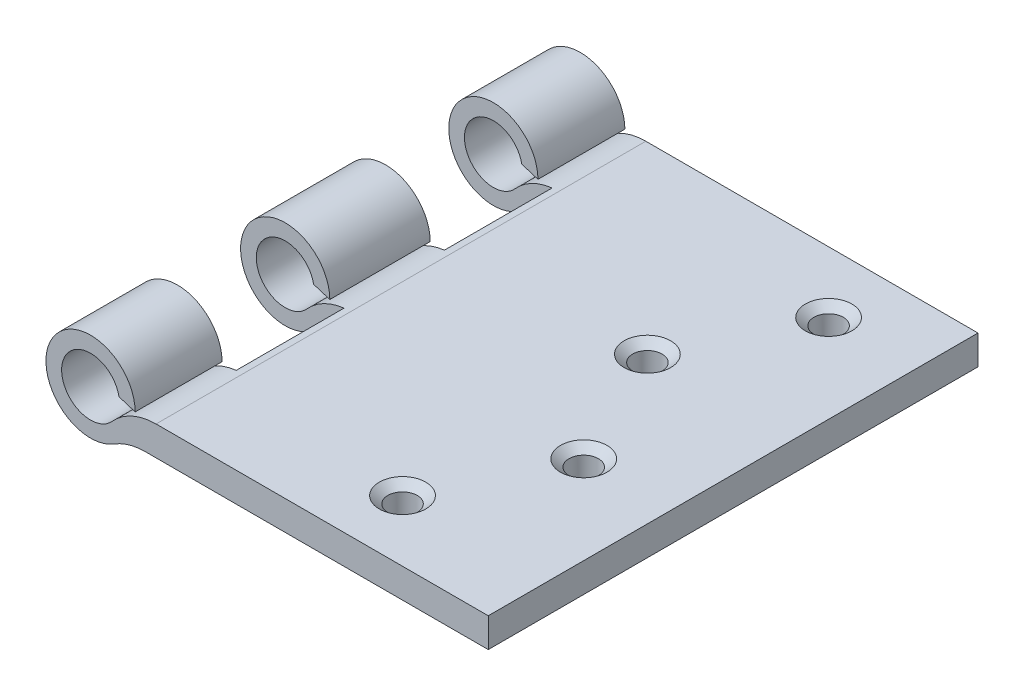
ISO-10303-21;
HEADER;
FILE_DESCRIPTION(('STEP AP214'),'2;1');
FILE_NAME('part.step','',(''),(''),'','','');
FILE_SCHEMA(('AUTOMOTIVE_DESIGN { 1 0 10303 214 1 1 1 1 }'));
ENDSEC;
DATA;
#1=APPLICATION_CONTEXT('core data for automotive mechanical design processes');
#2=APPLICATION_PROTOCOL_DEFINITION('international standard','automotive_design',2000,#1);
#3=PRODUCT_CONTEXT('',#1,'mechanical');
#4=PRODUCT('Part','Part','',(#3));
#5=PRODUCT_RELATED_PRODUCT_CATEGORY('part','',(#4));
#6=PRODUCT_DEFINITION_FORMATION('','',#4);
#7=PRODUCT_DEFINITION_CONTEXT('part definition',#1,'design');
#8=PRODUCT_DEFINITION('design','',#6,#7);
#9=PRODUCT_DEFINITION_SHAPE('','',#8);
#10=(LENGTH_UNIT() NAMED_UNIT(*) SI_UNIT(.MILLI.,.METRE.));
#11=(NAMED_UNIT(*) PLANE_ANGLE_UNIT() SI_UNIT($,.RADIAN.));
#12=(NAMED_UNIT(*) SI_UNIT($,.STERADIAN.) SOLID_ANGLE_UNIT());
#13=UNCERTAINTY_MEASURE_WITH_UNIT(LENGTH_MEASURE(1.E-05),#10,'distance_accuracy_value','');
#14=(GEOMETRIC_REPRESENTATION_CONTEXT(3) GLOBAL_UNCERTAINTY_ASSIGNED_CONTEXT((#13)) GLOBAL_UNIT_ASSIGNED_CONTEXT((#10,
#11,#12)) REPRESENTATION_CONTEXT('',''));
#15=CARTESIAN_POINT('',(0.,0.,0.));
#16=DIRECTION('',(0.,0.,1.));
#17=DIRECTION('',(1.,0.,0.));
#18=AXIS2_PLACEMENT_3D('',#15,#16,#17);
#19=CARTESIAN_POINT('',(6.68804904288239,-5.955,25.));
#20=DIRECTION('',(0.,0.,-1.));
#21=DIRECTION('',(-1.,0.,0.));
#22=AXIS2_PLACEMENT_3D('',#19,#20,#21);
#23=CYLINDRICAL_SURFACE('',#22,6.);
#24=CARTESIAN_POINT('',(6.68804904288239,-5.955,-16.125));
#25=DIRECTION('',(0.,0.,1.));
#26=DIRECTION('',(1.,0.,0.));
#27=AXIS2_PLACEMENT_3D('',#24,#25,#26);
#28=CIRCLE('',#27,6.);
#29=CARTESIAN_POINT('',(6.,0.00541848485394788,-16.125));
#30=VERTEX_POINT('',#29);
#31=CARTESIAN_POINT('',(2.20694415652903,-1.96505025125628,-16.125));
#32=VERTEX_POINT('',#31);
#33=EDGE_CURVE('E300',#30,#32,#28,.T.);
#34=ORIENTED_EDGE('',*,*,#33,.F.);
#35=DIRECTION('',(0.,0.,-1.));
#36=VECTOR('',#35,1.);
#37=CARTESIAN_POINT('',(6.00000000000002,0.00541848485394961,25.));
#38=LINE('',#37,#36);
#39=CARTESIAN_POINT('',(6.,0.00541848485394788,-5.125));
#40=VERTEX_POINT('',#39);
#41=EDGE_CURVE('E302',#40,#30,#38,.T.);
#42=ORIENTED_EDGE('',*,*,#41,.F.);
#43=CARTESIAN_POINT('',(6.68804904288239,-5.955,-5.125));
#44=DIRECTION('',(0.,0.,-1.));
#45=DIRECTION('',(-1.,0.,0.));
#46=AXIS2_PLACEMENT_3D('',#43,#44,#45);
#47=CIRCLE('',#46,6.);
#48=CARTESIAN_POINT('',(2.20694415652903,-1.96505025125628,-5.125));
#49=VERTEX_POINT('',#48);
#50=EDGE_CURVE('E290',#49,#40,#47,.T.);
#51=ORIENTED_EDGE('',*,*,#50,.F.);
#52=DIRECTION('',(0.,0.,-1.));
#53=VECTOR('',#52,1.);
#54=CARTESIAN_POINT('',(2.20694415652903,-1.96505025125628,25.));
#55=LINE('',#54,#53);
#56=CARTESIAN_POINT('',(2.20694415652903,-1.96505025125628,5.125));
#57=VERTEX_POINT('',#56);
#58=EDGE_CURVE('E358',#57,#49,#55,.T.);
#59=ORIENTED_EDGE('',*,*,#58,.F.);
#60=CARTESIAN_POINT('',(6.68804904288239,-5.955,5.125));
#61=DIRECTION('',(0.,0.,1.));
#62=DIRECTION('',(1.,0.,0.));
#63=AXIS2_PLACEMENT_3D('',#60,#61,#62);
#64=CIRCLE('',#63,6.);
#65=CARTESIAN_POINT('',(6.,0.00541848485394788,5.125));
#66=VERTEX_POINT('',#65);
#67=EDGE_CURVE('E278',#66,#57,#64,.T.);
#68=ORIENTED_EDGE('',*,*,#67,.F.);
#69=DIRECTION('',(0.,0.,-1.));
#70=VECTOR('',#69,1.);
#71=CARTESIAN_POINT('',(6.00000000000001,0.00541848485394875,25.));
#72=LINE('',#71,#70);
#73=CARTESIAN_POINT('',(6.00000000000001,0.00541848485394875,16.125));
#74=VERTEX_POINT('',#73);
#75=EDGE_CURVE('E280',#74,#66,#72,.T.);
#76=ORIENTED_EDGE('',*,*,#75,.F.);
#77=CARTESIAN_POINT('',(6.68804904288239,-5.955,16.125));
#78=DIRECTION('',(0.,0.,-1.));
#79=DIRECTION('',(-1.,0.,0.));
#80=AXIS2_PLACEMENT_3D('',#77,#78,#79);
#81=CIRCLE('',#80,6.);
#82=CARTESIAN_POINT('',(2.20694415652903,-1.96505025125628,16.125));
#83=VERTEX_POINT('',#82);
#84=EDGE_CURVE('E268',#83,#74,#81,.T.);
#85=ORIENTED_EDGE('',*,*,#84,.F.);
#86=CARTESIAN_POINT('',(2.20694415652903,-1.96505025125628,25.));
#87=VERTEX_POINT('',#86);
#88=EDGE_CURVE('E354',#87,#83,#55,.T.);
#89=ORIENTED_EDGE('',*,*,#88,.F.);
#90=CARTESIAN_POINT('',(6.68804904288239,-5.955,25.));
#91=DIRECTION('',(0.,0.,1.));
#92=DIRECTION('',(1.,0.,0.));
#93=AXIS2_PLACEMENT_3D('',#90,#91,#92);
#94=CIRCLE('',#93,6.);
#95=CARTESIAN_POINT('',(6.68804904288239,0.0449999999999999,25.));
#96=VERTEX_POINT('',#95);
#97=EDGE_CURVE('E305',#96,#87,#94,.T.);
#98=ORIENTED_EDGE('',*,*,#97,.F.);
#99=DIRECTION('',(0.,0.,-1.));
#100=VECTOR('',#99,1.);
#101=CARTESIAN_POINT('',(6.68804904288239,0.0449999999999999,25.));
#102=LINE('',#101,#100);
#103=CARTESIAN_POINT('',(6.68804904288239,0.0449999999999999,-25.));
#104=VERTEX_POINT('',#103);
#105=EDGE_CURVE('E216',#96,#104,#102,.T.);
#106=ORIENTED_EDGE('',*,*,#105,.T.);
#107=CARTESIAN_POINT('',(6.68804904288239,-5.955,-25.));
#108=DIRECTION('',(0.,0.,1.));
#109=DIRECTION('',(1.,0.,0.));
#110=AXIS2_PLACEMENT_3D('',#107,#108,#109);
#111=CIRCLE('',#110,6.);
#112=CARTESIAN_POINT('',(2.20694415652903,-1.96505025125628,-25.));
#113=VERTEX_POINT('',#112);
#114=EDGE_CURVE('E304',#104,#113,#111,.T.);
#115=ORIENTED_EDGE('',*,*,#114,.T.);
#116=EDGE_CURVE('E352',#32,#113,#55,.T.);
#117=ORIENTED_EDGE('',*,*,#116,.F.);
#118=EDGE_LOOP('',(#34,#42,#51,#59,#68,#76,#85,#89,#98,#106,#115,#117));
#119=FACE_BOUND('',#118,.T.);
#120=ADVANCED_FACE('F36',(#119),#23,.T.);
#121=CARTESIAN_POINT('',(0.,0.,25.));
#122=DIRECTION('',(0.,0.,-1.));
#123=DIRECTION('',(-1.,0.,0.));
#124=AXIS2_PLACEMENT_3D('',#121,#122,#123);
#125=CYLINDRICAL_SURFACE('',#124,2.955);
#126=CARTESIAN_POINT('',(0.,0.,-16.125));
#127=DIRECTION('',(0.,0.,1.));
#128=DIRECTION('',(1.,0.,0.));
#129=AXIS2_PLACEMENT_3D('',#126,#127,#128);
#130=CIRCLE('',#129,2.955);
#131=CARTESIAN_POINT('',(2.90142257836706,0.560153569784056,-16.125));
#132=VERTEX_POINT('',#131);
#133=EDGE_CURVE('E298',#32,#132,#130,.F.);
#134=ORIENTED_EDGE('',*,*,#133,.F.);
#135=ORIENTED_EDGE('',*,*,#116,.T.);
#136=CARTESIAN_POINT('',(0.,0.,-25.));
#137=DIRECTION('',(0.,0.,-1.));
#138=DIRECTION('',(1.,0.,0.));
#139=AXIS2_PLACEMENT_3D('',#136,#137,#138);
#140=CIRCLE('',#139,2.955);
#141=CARTESIAN_POINT('',(2.90142257836706,0.560153569784056,-25.));
#142=VERTEX_POINT('',#141);
#143=EDGE_CURVE('E321',#113,#142,#140,.T.);
#144=ORIENTED_EDGE('',*,*,#143,.T.);
#145=DIRECTION('',(0.,0.,-1.));
#146=VECTOR('',#145,1.);
#147=CARTESIAN_POINT('',(2.90142257836706,0.560153569784056,25.));
#148=LINE('',#147,#146);
#149=EDGE_CURVE('E347',#132,#142,#148,.T.);
#150=ORIENTED_EDGE('',*,*,#149,.F.);
#151=EDGE_LOOP('',(#134,#135,#144,#150));
#152=FACE_BOUND('',#151,.T.);
#153=ADVANCED_FACE('F426',(#152),#125,.F.);
#154=CARTESIAN_POINT('',(0.,0.,-5.125));
#155=DIRECTION('',(0.,0.,-1.));
#156=DIRECTION('',(-1.,0.,0.));
#157=AXIS2_PLACEMENT_3D('',#154,#155,#156);
#158=CIRCLE('',#157,2.955);
#159=CARTESIAN_POINT('',(2.90142257836706,0.560153569784056,-5.125));
#160=VERTEX_POINT('',#159);
#161=EDGE_CURVE('E288',#160,#49,#158,.F.);
#162=ORIENTED_EDGE('',*,*,#161,.F.);
#163=CARTESIAN_POINT('',(2.90142257836706,0.560153569784056,5.125));
#164=VERTEX_POINT('',#163);
#165=EDGE_CURVE('E353',#164,#160,#148,.T.);
#166=ORIENTED_EDGE('',*,*,#165,.F.);
#167=CARTESIAN_POINT('',(0.,0.,5.125));
#168=DIRECTION('',(0.,0.,1.));
#169=DIRECTION('',(1.,0.,0.));
#170=AXIS2_PLACEMENT_3D('',#167,#168,#169);
#171=CIRCLE('',#170,2.955);
#172=EDGE_CURVE('E276',#57,#164,#171,.F.);
#173=ORIENTED_EDGE('',*,*,#172,.F.);
#174=ORIENTED_EDGE('',*,*,#58,.T.);
#175=EDGE_LOOP('',(#162,#166,#173,#174));
#176=FACE_BOUND('',#175,.T.);
#177=ADVANCED_FACE('F429',(#176),#125,.F.);
#178=CARTESIAN_POINT('',(0.,0.,16.125));
#179=DIRECTION('',(0.,0.,-1.));
#180=DIRECTION('',(-1.,0.,0.));
#181=AXIS2_PLACEMENT_3D('',#178,#179,#180);
#182=CIRCLE('',#181,2.955);
#183=CARTESIAN_POINT('',(2.90142257836706,0.560153569784056,16.125));
#184=VERTEX_POINT('',#183);
#185=EDGE_CURVE('E266',#184,#83,#182,.F.);
#186=ORIENTED_EDGE('',*,*,#185,.F.);
#187=CARTESIAN_POINT('',(2.90142257836706,0.560153569784056,25.));
#188=VERTEX_POINT('',#187);
#189=EDGE_CURVE('E349',#188,#184,#148,.T.);
#190=ORIENTED_EDGE('',*,*,#189,.F.);
#191=CARTESIAN_POINT('',(0.,0.,25.));
#192=DIRECTION('',(0.,0.,-1.));
#193=DIRECTION('',(1.,0.,0.));
#194=AXIS2_PLACEMENT_3D('',#191,#192,#193);
#195=CIRCLE('',#194,2.955);
#196=EDGE_CURVE('E308',#87,#188,#195,.T.);
#197=ORIENTED_EDGE('',*,*,#196,.F.);
#198=ORIENTED_EDGE('',*,*,#88,.T.);
#199=EDGE_LOOP('',(#186,#190,#197,#198));
#200=FACE_BOUND('',#199,.T.);
#201=ADVANCED_FACE('F424',(#200),#125,.F.);
#202=CARTESIAN_POINT('',(4.55477771137078,0.0449999999999999,25.));
#203=DIRECTION('',(0.297475301866081,0.954729513935588,0.));
#204=DIRECTION('',(-0.954729513935588,0.297475301866081,0.));
#205=AXIS2_PLACEMENT_3D('',#202,#203,#204);
#206=PLANE('',#205);
#207=DIRECTION('',(0.954729513935588,-0.297475301866081,0.));
#208=VECTOR('',#207,1.);
#209=CARTESIAN_POINT('',(4.55477771137077,0.0450000000000033,-16.125));
#210=LINE('',#209,#208);
#211=CARTESIAN_POINT('',(4.55477771137078,0.0449999999999999,-16.125));
#212=VERTEX_POINT('',#211);
#213=EDGE_CURVE('E296',#132,#212,#210,.T.);
#214=ORIENTED_EDGE('',*,*,#213,.F.);
#215=ORIENTED_EDGE('',*,*,#149,.T.);
#216=DIRECTION('',(0.954729513935588,-0.297475301866081,0.));
#217=VECTOR('',#216,1.);
#218=CARTESIAN_POINT('',(4.55477771137078,0.0449999999999999,-25.));
#219=LINE('',#218,#217);
#220=CARTESIAN_POINT('',(4.55477771137078,0.0449999999999999,-25.));
#221=VERTEX_POINT('',#220);
#222=EDGE_CURVE('E324',#142,#221,#219,.T.);
#223=ORIENTED_EDGE('',*,*,#222,.T.);
#224=DIRECTION('',(0.,0.,-1.));
#225=VECTOR('',#224,1.);
#226=CARTESIAN_POINT('',(4.55477771137078,0.0449999999999999,25.));
#227=LINE('',#226,#225);
#228=EDGE_CURVE('E342',#212,#221,#227,.T.);
#229=ORIENTED_EDGE('',*,*,#228,.F.);
#230=EDGE_LOOP('',(#214,#215,#223,#229));
#231=FACE_BOUND('',#230,.T.);
#232=ADVANCED_FACE('F420',(#231),#206,.F.);
#233=DIRECTION('',(-0.954729513935588,0.297475301866081,0.));
#234=VECTOR('',#233,1.);
#235=CARTESIAN_POINT('',(4.55477771137078,0.0449999999999999,-5.125));
#236=LINE('',#235,#234);
#237=CARTESIAN_POINT('',(4.55477771137078,0.0449999999999999,-5.125));
#238=VERTEX_POINT('',#237);
#239=EDGE_CURVE('E286',#238,#160,#236,.T.);
#240=ORIENTED_EDGE('',*,*,#239,.F.);
#241=CARTESIAN_POINT('',(4.55477771137078,0.0449999999999999,5.125));
#242=VERTEX_POINT('',#241);
#243=EDGE_CURVE('E348',#242,#238,#227,.T.);
#244=ORIENTED_EDGE('',*,*,#243,.F.);
#245=DIRECTION('',(0.954729513935588,-0.297475301866081,0.));
#246=VECTOR('',#245,1.);
#247=CARTESIAN_POINT('',(4.55477771137077,0.0450000000000015,5.125));
#248=LINE('',#247,#246);
#249=EDGE_CURVE('E274',#164,#242,#248,.T.);
#250=ORIENTED_EDGE('',*,*,#249,.F.);
#251=ORIENTED_EDGE('',*,*,#165,.T.);
#252=EDGE_LOOP('',(#240,#244,#250,#251));
#253=FACE_BOUND('',#252,.T.);
#254=ADVANCED_FACE('F423',(#253),#206,.F.);
#255=DIRECTION('',(-0.954729513935588,0.297475301866081,0.));
#256=VECTOR('',#255,1.);
#257=CARTESIAN_POINT('',(4.55477771137078,0.0449999999999999,16.125));
#258=LINE('',#257,#256);
#259=CARTESIAN_POINT('',(4.55477771137078,0.0449999999999999,16.125));
#260=VERTEX_POINT('',#259);
#261=EDGE_CURVE('E264',#260,#184,#258,.T.);
#262=ORIENTED_EDGE('',*,*,#261,.F.);
#263=CARTESIAN_POINT('',(4.55477771137078,0.0449999999999999,25.));
#264=VERTEX_POINT('',#263);
#265=EDGE_CURVE('E344',#264,#260,#227,.T.);
#266=ORIENTED_EDGE('',*,*,#265,.F.);
#267=DIRECTION('',(0.954729513935588,-0.297475301866081,0.));
#268=VECTOR('',#267,1.);
#269=CARTESIAN_POINT('',(4.55477771137078,0.0449999999999999,25.));
#270=LINE('',#269,#268);
#271=EDGE_CURVE('E310',#188,#264,#270,.T.);
#272=ORIENTED_EDGE('',*,*,#271,.F.);
#273=ORIENTED_EDGE('',*,*,#189,.T.);
#274=EDGE_LOOP('',(#262,#266,#272,#273));
#275=FACE_BOUND('',#274,.T.);
#276=ADVANCED_FACE('F418',(#275),#206,.F.);
#277=CARTESIAN_POINT('',(0.,0.,25.));
#278=DIRECTION('',(0.,0.,-1.));
#279=DIRECTION('',(-1.,0.,0.));
#280=AXIS2_PLACEMENT_3D('',#277,#278,#279);
#281=CYLINDRICAL_SURFACE('',#280,4.555);
#282=CARTESIAN_POINT('',(0.,0.,-16.125));
#283=DIRECTION('',(0.,0.,1.));
#284=DIRECTION('',(1.,0.,0.));
#285=AXIS2_PLACEMENT_3D('',#282,#283,#284);
#286=CIRCLE('',#285,4.555);
#287=CARTESIAN_POINT('',(2.41111969020166,-3.86452155376599,-16.125));
#288=VERTEX_POINT('',#287);
#289=EDGE_CURVE('E294',#212,#288,#286,.T.);
#290=ORIENTED_EDGE('',*,*,#289,.F.);
#291=ORIENTED_EDGE('',*,*,#228,.T.);
#292=CARTESIAN_POINT('',(0.,0.,-25.));
#293=DIRECTION('',(0.,0.,1.));
#294=DIRECTION('',(1.,0.,0.));
#295=AXIS2_PLACEMENT_3D('',#292,#293,#294);
#296=CIRCLE('',#295,4.555);
#297=CARTESIAN_POINT('',(2.41111969020166,-3.86452155376599,-25.));
#298=VERTEX_POINT('',#297);
#299=EDGE_CURVE('E327',#221,#298,#296,.T.);
#300=ORIENTED_EDGE('',*,*,#299,.T.);
#301=DIRECTION('',(0.,0.,-1.));
#302=VECTOR('',#301,1.);
#303=CARTESIAN_POINT('',(2.41111969020166,-3.86452155376599,25.));
#304=LINE('',#303,#302);
#305=EDGE_CURVE('E337',#288,#298,#304,.T.);
#306=ORIENTED_EDGE('',*,*,#305,.F.);
#307=EDGE_LOOP('',(#290,#291,#300,#306));
#308=FACE_BOUND('',#307,.T.);
#309=ADVANCED_FACE('F414',(#308),#281,.T.);
#310=CARTESIAN_POINT('',(0.,0.,-5.125));
#311=DIRECTION('',(0.,0.,-1.));
#312=DIRECTION('',(-1.,0.,0.));
#313=AXIS2_PLACEMENT_3D('',#310,#311,#312);
#314=CIRCLE('',#313,4.555);
#315=CARTESIAN_POINT('',(2.41111969020166,-3.86452155376599,-5.125));
#316=VERTEX_POINT('',#315);
#317=EDGE_CURVE('E284',#316,#238,#314,.T.);
#318=ORIENTED_EDGE('',*,*,#317,.F.);
#319=CARTESIAN_POINT('',(2.41111969020166,-3.86452155376599,5.125));
#320=VERTEX_POINT('',#319);
#321=EDGE_CURVE('E343',#320,#316,#304,.T.);
#322=ORIENTED_EDGE('',*,*,#321,.F.);
#323=CARTESIAN_POINT('',(0.,0.,5.125));
#324=DIRECTION('',(0.,0.,1.));
#325=DIRECTION('',(1.,0.,0.));
#326=AXIS2_PLACEMENT_3D('',#323,#324,#325);
#327=CIRCLE('',#326,4.555);
#328=EDGE_CURVE('E272',#242,#320,#327,.T.);
#329=ORIENTED_EDGE('',*,*,#328,.F.);
#330=ORIENTED_EDGE('',*,*,#243,.T.);
#331=EDGE_LOOP('',(#318,#322,#329,#330));
#332=FACE_BOUND('',#331,.T.);
#333=ADVANCED_FACE('F417',(#332),#281,.T.);
#334=CARTESIAN_POINT('',(0.,0.,16.125));
#335=DIRECTION('',(0.,0.,-1.));
#336=DIRECTION('',(-1.,0.,0.));
#337=AXIS2_PLACEMENT_3D('',#334,#335,#336);
#338=CIRCLE('',#337,4.555);
#339=CARTESIAN_POINT('',(2.41111969020166,-3.86452155376599,16.125));
#340=VERTEX_POINT('',#339);
#341=EDGE_CURVE('E262',#340,#260,#338,.T.);
#342=ORIENTED_EDGE('',*,*,#341,.F.);
#343=CARTESIAN_POINT('',(2.41111969020166,-3.86452155376599,25.));
#344=VERTEX_POINT('',#343);
#345=EDGE_CURVE('E339',#344,#340,#304,.T.);
#346=ORIENTED_EDGE('',*,*,#345,.F.);
#347=CARTESIAN_POINT('',(0.,0.,25.));
#348=DIRECTION('',(0.,0.,1.));
#349=DIRECTION('',(1.,0.,0.));
#350=AXIS2_PLACEMENT_3D('',#347,#348,#349);
#351=CIRCLE('',#350,4.555);
#352=EDGE_CURVE('E312',#264,#344,#351,.T.);
#353=ORIENTED_EDGE('',*,*,#352,.F.);
#354=ORIENTED_EDGE('',*,*,#265,.T.);
#355=EDGE_LOOP('',(#342,#346,#353,#354));
#356=FACE_BOUND('',#355,.T.);
#357=ADVANCED_FACE('F412',(#356),#281,.T.);
#358=CARTESIAN_POINT('',(5.58712806368353,-8.955,25.));
#359=DIRECTION('',(0.,0.,-1.));
#360=DIRECTION('',(-1.,0.,0.));
#361=AXIS2_PLACEMENT_3D('',#358,#359,#360);
#362=CYLINDRICAL_SURFACE('',#361,6.);
#363=CARTESIAN_POINT('',(5.58712806368353,-8.955,-16.125));
#364=DIRECTION('',(0.,0.,1.));
#365=DIRECTION('',(1.,0.,0.));
#366=AXIS2_PLACEMENT_3D('',#363,#364,#365);
#367=CIRCLE('',#366,6.);
#368=CARTESIAN_POINT('',(5.58712806368353,-2.955,-16.125));
#369=VERTEX_POINT('',#368);
#370=EDGE_CURVE('E292',#288,#369,#367,.F.);
#371=ORIENTED_EDGE('',*,*,#370,.F.);
#372=ORIENTED_EDGE('',*,*,#305,.T.);
#373=CARTESIAN_POINT('',(5.58712806368353,-8.955,-25.));
#374=DIRECTION('',(0.,0.,-1.));
#375=DIRECTION('',(1.,0.,0.));
#376=AXIS2_PLACEMENT_3D('',#373,#374,#375);
#377=CIRCLE('',#376,6.);
#378=CARTESIAN_POINT('',(5.58712806368353,-2.955,-25.));
#379=VERTEX_POINT('',#378);
#380=EDGE_CURVE('E208',#298,#379,#377,.T.);
#381=ORIENTED_EDGE('',*,*,#380,.T.);
#382=DIRECTION('',(0.,0.,-1.));
#383=VECTOR('',#382,1.);
#384=CARTESIAN_POINT('',(5.58712806368353,-2.955,25.));
#385=LINE('',#384,#383);
#386=EDGE_CURVE('E202',#369,#379,#385,.T.);
#387=ORIENTED_EDGE('',*,*,#386,.F.);
#388=EDGE_LOOP('',(#371,#372,#381,#387));
#389=FACE_BOUND('',#388,.T.);
#390=ADVANCED_FACE('F408',(#389),#362,.F.);
#391=CARTESIAN_POINT('',(5.58712806368353,-8.955,-5.125));
#392=DIRECTION('',(0.,0.,-1.));
#393=DIRECTION('',(-1.,0.,0.));
#394=AXIS2_PLACEMENT_3D('',#391,#392,#393);
#395=CIRCLE('',#394,6.);
#396=CARTESIAN_POINT('',(5.58712806368353,-2.955,-5.125));
#397=VERTEX_POINT('',#396);
#398=EDGE_CURVE('E282',#397,#316,#395,.F.);
#399=ORIENTED_EDGE('',*,*,#398,.F.);
#400=CARTESIAN_POINT('',(5.58712806368353,-2.955,5.125));
#401=VERTEX_POINT('',#400);
#402=EDGE_CURVE('E338',#401,#397,#385,.T.);
#403=ORIENTED_EDGE('',*,*,#402,.F.);
#404=CARTESIAN_POINT('',(5.58712806368353,-8.955,5.125));
#405=DIRECTION('',(0.,0.,1.));
#406=DIRECTION('',(1.,0.,0.));
#407=AXIS2_PLACEMENT_3D('',#404,#405,#406);
#408=CIRCLE('',#407,6.);
#409=EDGE_CURVE('E270',#320,#401,#408,.F.);
#410=ORIENTED_EDGE('',*,*,#409,.F.);
#411=ORIENTED_EDGE('',*,*,#321,.T.);
#412=EDGE_LOOP('',(#399,#403,#410,#411));
#413=FACE_BOUND('',#412,.T.);
#414=ADVANCED_FACE('F411',(#413),#362,.F.);
#415=CARTESIAN_POINT('',(5.58712806368353,-8.955,16.125));
#416=DIRECTION('',(0.,0.,-1.));
#417=DIRECTION('',(-1.,0.,0.));
#418=AXIS2_PLACEMENT_3D('',#415,#416,#417);
#419=CIRCLE('',#418,6.);
#420=CARTESIAN_POINT('',(5.58712806368353,-2.955,16.125));
#421=VERTEX_POINT('',#420);
#422=EDGE_CURVE('E257',#421,#340,#419,.F.);
#423=ORIENTED_EDGE('',*,*,#422,.F.);
#424=CARTESIAN_POINT('',(5.58712806368353,-2.955,25.));
#425=VERTEX_POINT('',#424);
#426=EDGE_CURVE('E334',#425,#421,#385,.T.);
#427=ORIENTED_EDGE('',*,*,#426,.F.);
#428=CARTESIAN_POINT('',(5.58712806368353,-8.955,25.));
#429=DIRECTION('',(0.,0.,-1.));
#430=DIRECTION('',(1.,0.,0.));
#431=AXIS2_PLACEMENT_3D('',#428,#429,#430);
#432=CIRCLE('',#431,6.);
#433=EDGE_CURVE('E314',#344,#425,#432,.T.);
#434=ORIENTED_EDGE('',*,*,#433,.F.);
#435=ORIENTED_EDGE('',*,*,#345,.T.);
#436=EDGE_LOOP('',(#423,#427,#434,#435));
#437=FACE_BOUND('',#436,.T.);
#438=ADVANCED_FACE('F405',(#437),#362,.F.);
#439=CARTESIAN_POINT('',(5.58712806368353,-2.955,25.));
#440=DIRECTION('',(0.,1.,0.));
#441=DIRECTION('',(0.,0.,1.));
#442=AXIS2_PLACEMENT_3D('',#439,#440,#441);
#443=PLANE('',#442);
#444=CARTESIAN_POINT('',(31.6,-2.955,-18.75));
#445=DIRECTION('',(0.,1.,0.));
#446=DIRECTION('',(0.,0.,1.));
#447=AXIS2_PLACEMENT_3D('',#444,#445,#446);
#448=CIRCLE('',#447,1.5);
#449=CARTESIAN_POINT('',(31.6,-2.955,-17.25));
#450=VERTEX_POINT('',#449);
#451=EDGE_CURVE('E249',#450,#450,#448,.T.);
#452=ORIENTED_EDGE('',*,*,#451,.T.);
#453=EDGE_LOOP('',(#452));
#454=FACE_BOUND('',#453,.T.);
#455=CARTESIAN_POINT('',(25.6,-2.955,-6.25));
#456=DIRECTION('',(0.,1.,0.));
#457=DIRECTION('',(0.,0.,1.));
#458=AXIS2_PLACEMENT_3D('',#455,#456,#457);
#459=CIRCLE('',#458,1.5);
#460=CARTESIAN_POINT('',(25.6,-2.955,-4.75));
#461=VERTEX_POINT('',#460);
#462=EDGE_CURVE('E246',#461,#461,#459,.T.);
#463=ORIENTED_EDGE('',*,*,#462,.T.);
#464=EDGE_LOOP('',(#463));
#465=FACE_BOUND('',#464,.T.);
#466=CARTESIAN_POINT('',(31.6,-2.955,6.25));
#467=DIRECTION('',(0.,1.,0.));
#468=DIRECTION('',(0.,0.,1.));
#469=AXIS2_PLACEMENT_3D('',#466,#467,#468);
#470=CIRCLE('',#469,1.5);
#471=CARTESIAN_POINT('',(31.6,-2.955,7.75000000000001));
#472=VERTEX_POINT('',#471);
#473=EDGE_CURVE('E242',#472,#472,#470,.T.);
#474=ORIENTED_EDGE('',*,*,#473,.T.);
#475=EDGE_LOOP('',(#474));
#476=FACE_BOUND('',#475,.T.);
#477=CARTESIAN_POINT('',(25.6,-2.955,18.75));
#478=DIRECTION('',(0.,1.,0.));
#479=DIRECTION('',(0.,0.,1.));
#480=AXIS2_PLACEMENT_3D('',#477,#478,#479);
#481=CIRCLE('',#480,1.5);
#482=CARTESIAN_POINT('',(25.6,-2.955,20.25));
#483=VERTEX_POINT('',#482);
#484=EDGE_CURVE('E239',#483,#483,#481,.T.);
#485=ORIENTED_EDGE('',*,*,#484,.T.);
#486=EDGE_LOOP('',(#485));
#487=FACE_BOUND('',#486,.T.);
#488=DIRECTION('',(1.,0.,0.));
#489=VECTOR('',#488,1.);
#490=CARTESIAN_POINT('',(5.58712806368351,-2.955,-16.125));
#491=LINE('',#490,#489);
#492=CARTESIAN_POINT('',(6.,-2.955,-16.125));
#493=VERTEX_POINT('',#492);
#494=EDGE_CURVE('E368',#369,#493,#491,.T.);
#495=ORIENTED_EDGE('',*,*,#494,.F.);
#496=ORIENTED_EDGE('',*,*,#386,.T.);
#497=DIRECTION('',(1.,0.,0.));
#498=VECTOR('',#497,1.);
#499=CARTESIAN_POINT('',(5.58712806368353,-2.955,-25.));
#500=LINE('',#499,#498);
#501=CARTESIAN_POINT('',(36.,-2.95187501994081,-25.));
#502=VERTEX_POINT('',#501);
#503=EDGE_CURVE('E193',#379,#502,#500,.T.);
#504=ORIENTED_EDGE('',*,*,#503,.T.);
#505=CARTESIAN_POINT('',(36.,-2.94875003988162,25.));
#506=DIRECTION('',(0.,0.,-1.));
#507=VECTOR('',#506,1.);
#508=LINE('',#505,#507);
#509=CARTESIAN_POINT('',(36.,-2.95187501994081,25.));
#510=VERTEX_POINT('',#509);
#511=EDGE_CURVE('E198',#510,#502,#508,.T.);
#512=ORIENTED_EDGE('',*,*,#511,.F.);
#513=DIRECTION('',(1.,0.,0.));
#514=VECTOR('',#513,1.);
#515=CARTESIAN_POINT('',(5.58712806368353,-2.955,25.));
#516=LINE('',#515,#514);
#517=EDGE_CURVE('E316',#425,#510,#516,.T.);
#518=ORIENTED_EDGE('',*,*,#517,.F.);
#519=ORIENTED_EDGE('',*,*,#426,.T.);
#520=DIRECTION('',(-1.,0.,0.));
#521=VECTOR('',#520,1.);
#522=CARTESIAN_POINT('',(5.58712806368353,-2.955,16.125));
#523=LINE('',#522,#521);
#524=CARTESIAN_POINT('',(6.00000000000001,-2.955,16.125));
#525=VERTEX_POINT('',#524);
#526=EDGE_CURVE('E357',#525,#421,#523,.T.);
#527=ORIENTED_EDGE('',*,*,#526,.F.);
#528=DIRECTION('',(0.,0.,1.));
#529=VECTOR('',#528,1.);
#530=CARTESIAN_POINT('',(6.00000000000001,-2.955,25.));
#531=LINE('',#530,#529);
#532=CARTESIAN_POINT('',(6.,-2.955,5.125));
#533=VERTEX_POINT('',#532);
#534=EDGE_CURVE('E360',#533,#525,#531,.T.);
#535=ORIENTED_EDGE('',*,*,#534,.F.);
#536=DIRECTION('',(1.,0.,0.));
#537=VECTOR('',#536,1.);
#538=CARTESIAN_POINT('',(5.58712806368352,-2.955,5.125));
#539=LINE('',#538,#537);
#540=EDGE_CURVE('E362',#401,#533,#539,.T.);
#541=ORIENTED_EDGE('',*,*,#540,.F.);
#542=ORIENTED_EDGE('',*,*,#402,.T.);
#543=DIRECTION('',(-1.,0.,0.));
#544=VECTOR('',#543,1.);
#545=CARTESIAN_POINT('',(5.58712806368353,-2.955,-5.125));
#546=LINE('',#545,#544);
#547=CARTESIAN_POINT('',(6.,-2.955,-5.125));
#548=VERTEX_POINT('',#547);
#549=EDGE_CURVE('E364',#548,#397,#546,.T.);
#550=ORIENTED_EDGE('',*,*,#549,.F.);
#551=DIRECTION('',(0.,0.,1.));
#552=VECTOR('',#551,1.);
#553=CARTESIAN_POINT('',(6.00000000000002,-2.955,25.));
#554=LINE('',#553,#552);
#555=EDGE_CURVE('E366',#493,#548,#554,.T.);
#556=ORIENTED_EDGE('',*,*,#555,.F.);
#557=EDGE_LOOP('',(#495,#496,#504,#512,#518,#519,#527,#535,#541,#542,#550,#556));
#558=FACE_BOUND('',#557,.T.);
#559=ADVANCED_FACE('F196',(#454,#465,#476,#487,#558),#443,.F.);
#560=CARTESIAN_POINT('',(6.68804904288239,0.0449999999999999,25.));
#561=DIRECTION('',(0.,-1.,0.));
#562=DIRECTION('',(1.,0.,0.));
#563=AXIS2_PLACEMENT_3D('',#560,#561,#562);
#564=PLANE('',#563);
#565=CARTESIAN_POINT('',(25.6,0.0449999999999993,18.75));
#566=DIRECTION('',(0.,-1.,0.));
#567=DIRECTION('',(1.,0.,0.));
#568=AXIS2_PLACEMENT_3D('',#565,#566,#567);
#569=CIRCLE('',#568,2.37500000000002);
#570=CARTESIAN_POINT('',(27.975,0.0449999999999993,18.75));
#571=VERTEX_POINT('',#570);
#572=EDGE_CURVE('E382',#571,#571,#569,.T.);
#573=ORIENTED_EDGE('',*,*,#572,.T.);
#574=EDGE_LOOP('',(#573));
#575=FACE_BOUND('',#574,.T.);
#576=CARTESIAN_POINT('',(31.6,0.0449999999999992,6.25));
#577=DIRECTION('',(0.,-1.,0.));
#578=DIRECTION('',(1.,0.,0.));
#579=AXIS2_PLACEMENT_3D('',#576,#577,#578);
#580=CIRCLE('',#579,2.37500000000002);
#581=CARTESIAN_POINT('',(33.975,0.0449999999999991,6.25));
#582=VERTEX_POINT('',#581);
#583=EDGE_CURVE('E379',#582,#582,#580,.T.);
#584=ORIENTED_EDGE('',*,*,#583,.T.);
#585=EDGE_LOOP('',(#584));
#586=FACE_BOUND('',#585,.T.);
#587=CARTESIAN_POINT('',(25.6,0.0449999999999993,-6.25));
#588=DIRECTION('',(0.,-1.,0.));
#589=DIRECTION('',(1.,0.,0.));
#590=AXIS2_PLACEMENT_3D('',#587,#588,#589);
#591=CIRCLE('',#590,2.37500000000002);
#592=CARTESIAN_POINT('',(27.975,0.0449999999999993,-6.25));
#593=VERTEX_POINT('',#592);
#594=EDGE_CURVE('E376',#593,#593,#591,.T.);
#595=ORIENTED_EDGE('',*,*,#594,.T.);
#596=EDGE_LOOP('',(#595));
#597=FACE_BOUND('',#596,.T.);
#598=CARTESIAN_POINT('',(31.6,0.0449999999999992,-18.75));
#599=DIRECTION('',(0.,-1.,0.));
#600=DIRECTION('',(1.,0.,0.));
#601=AXIS2_PLACEMENT_3D('',#598,#599,#600);
#602=CIRCLE('',#601,2.37500000000002);
#603=CARTESIAN_POINT('',(33.975,0.0449999999999991,-18.75));
#604=VERTEX_POINT('',#603);
#605=EDGE_CURVE('E373',#604,#604,#602,.T.);
#606=ORIENTED_EDGE('',*,*,#605,.T.);
#607=EDGE_LOOP('',(#606));
#608=FACE_BOUND('',#607,.T.);
#609=DIRECTION('',(-1.,0.,0.));
#610=VECTOR('',#609,1.);
#611=CARTESIAN_POINT('',(6.68804904288239,0.0449999999999999,-25.));
#612=LINE('',#611,#610);
#613=CARTESIAN_POINT('',(40.6025784615026,0.044999999999999,-25.));
#614=VERTEX_POINT('',#613);
#615=EDGE_CURVE('E207',#614,#104,#612,.T.);
#616=ORIENTED_EDGE('',*,*,#615,.T.);
#617=ORIENTED_EDGE('',*,*,#105,.F.);
#618=DIRECTION('',(-1.,0.,0.));
#619=VECTOR('',#618,1.);
#620=CARTESIAN_POINT('',(6.68804904288239,0.0449999999999999,25.));
#621=LINE('',#620,#619);
#622=CARTESIAN_POINT('',(40.6025784615026,0.044999999999999,25.));
#623=VERTEX_POINT('',#622);
#624=EDGE_CURVE('E317',#623,#96,#621,.T.);
#625=ORIENTED_EDGE('',*,*,#624,.F.);
#626=DIRECTION('',(0.,0.,1.));
#627=VECTOR('',#626,1.);
#628=CARTESIAN_POINT('',(40.6025784615026,0.044999999999999,-25.));
#629=LINE('',#628,#627);
#630=EDGE_CURVE('E243',#614,#623,#629,.T.);
#631=ORIENTED_EDGE('',*,*,#630,.F.);
#632=EDGE_LOOP('',(#616,#617,#625,#631));
#633=FACE_BOUND('',#632,.T.);
#634=ADVANCED_FACE('F404',(#575,#586,#597,#608,#633),#564,.F.);
#635=CARTESIAN_POINT('',(6.68804904288239,-5.955,25.));
#636=DIRECTION('',(0.,0.,1.));
#637=DIRECTION('',(1.,0.,0.));
#638=AXIS2_PLACEMENT_3D('',#635,#636,#637);
#639=PLANE('',#638);
#640=ORIENTED_EDGE('',*,*,#97,.T.);
#641=ORIENTED_EDGE('',*,*,#196,.T.);
#642=ORIENTED_EDGE('',*,*,#271,.T.);
#643=ORIENTED_EDGE('',*,*,#352,.T.);
#644=ORIENTED_EDGE('',*,*,#433,.T.);
#645=ORIENTED_EDGE('',*,*,#517,.T.);
#646=DIRECTION('',(1.,0.,0.));
#647=VECTOR('',#646,1.);
#648=CARTESIAN_POINT('',(36.,-2.94875003988162,25.));
#649=LINE('',#648,#647);
#650=CARTESIAN_POINT('',(40.6025784615026,-2.94875003988162,25.));
#651=VERTEX_POINT('',#650);
#652=EDGE_CURVE('E215',#510,#651,#649,.T.);
#653=ORIENTED_EDGE('',*,*,#652,.T.);
#654=DIRECTION('',(0.,1.,0.));
#655=VECTOR('',#654,1.);
#656=CARTESIAN_POINT('',(40.6025784615026,0.044999999999999,25.));
#657=LINE('',#656,#655);
#658=EDGE_CURVE('E224',#651,#623,#657,.T.);
#659=ORIENTED_EDGE('',*,*,#658,.T.);
#660=ORIENTED_EDGE('',*,*,#624,.T.);
#661=EDGE_LOOP('',(#640,#641,#642,#643,#644,#645,#653,#659,#660));
#662=FACE_BOUND('',#661,.T.);
#663=ADVANCED_FACE('F498',(#662),#639,.T.);
#664=CARTESIAN_POINT('',(6.68804904288239,-5.955,-25.));
#665=DIRECTION('',(0.,0.,1.));
#666=DIRECTION('',(1.,0.,0.));
#667=AXIS2_PLACEMENT_3D('',#664,#665,#666);
#668=PLANE('',#667);
#669=ORIENTED_EDGE('',*,*,#114,.F.);
#670=ORIENTED_EDGE('',*,*,#615,.F.);
#671=DIRECTION('',(0.,1.,0.));
#672=VECTOR('',#671,1.);
#673=CARTESIAN_POINT('',(40.6025784615026,0.044999999999999,-25.));
#674=LINE('',#673,#672);
#675=CARTESIAN_POINT('',(40.6025784615026,-2.94875003988162,-25.));
#676=VERTEX_POINT('',#675);
#677=EDGE_CURVE('E223',#676,#614,#674,.T.);
#678=ORIENTED_EDGE('',*,*,#677,.F.);
#679=DIRECTION('',(1.,0.,0.));
#680=VECTOR('',#679,1.);
#681=CARTESIAN_POINT('',(36.,-2.94875003988162,-25.));
#682=LINE('',#681,#680);
#683=EDGE_CURVE('E213',#502,#676,#682,.T.);
#684=ORIENTED_EDGE('',*,*,#683,.F.);
#685=ORIENTED_EDGE('',*,*,#503,.F.);
#686=ORIENTED_EDGE('',*,*,#380,.F.);
#687=ORIENTED_EDGE('',*,*,#299,.F.);
#688=ORIENTED_EDGE('',*,*,#222,.F.);
#689=ORIENTED_EDGE('',*,*,#143,.F.);
#690=EDGE_LOOP('',(#669,#670,#678,#684,#685,#686,#687,#688,#689));
#691=FACE_BOUND('',#690,.T.);
#692=ADVANCED_FACE('F221',(#691),#668,.F.);
#693=CARTESIAN_POINT('',(6.00000000000001,6.,16.125));
#694=DIRECTION('',(-1.,0.,0.));
#695=DIRECTION('',(0.,0.,1.));
#696=AXIS2_PLACEMENT_3D('',#693,#694,#695);
#697=PLANE('',#696);
#698=ORIENTED_EDGE('',*,*,#75,.T.);
#699=DIRECTION('',(0.,-1.,0.));
#700=VECTOR('',#699,1.);
#701=CARTESIAN_POINT('',(6.,6.,5.125));
#702=LINE('',#701,#700);
#703=EDGE_CURVE('E254',#66,#533,#702,.T.);
#704=ORIENTED_EDGE('',*,*,#703,.T.);
#705=ORIENTED_EDGE('',*,*,#534,.T.);
#706=DIRECTION('',(0.,-1.,0.));
#707=VECTOR('',#706,1.);
#708=CARTESIAN_POINT('',(6.00000000000001,6.,16.125));
#709=LINE('',#708,#707);
#710=EDGE_CURVE('E61',#74,#525,#709,.T.);
#711=ORIENTED_EDGE('',*,*,#710,.F.);
#712=EDGE_LOOP('',(#698,#704,#705,#711));
#713=FACE_BOUND('',#712,.T.);
#714=ADVANCED_FACE('F493',(#713),#697,.T.);
#715=CARTESIAN_POINT('',(-5.99999999999999,6.,5.125));
#716=DIRECTION('',(0.,0.,1.));
#717=DIRECTION('',(1.,0.,0.));
#718=AXIS2_PLACEMENT_3D('',#715,#716,#717);
#719=PLANE('',#718);
#720=ORIENTED_EDGE('',*,*,#67,.T.);
#721=ORIENTED_EDGE('',*,*,#172,.T.);
#722=ORIENTED_EDGE('',*,*,#249,.T.);
#723=ORIENTED_EDGE('',*,*,#328,.T.);
#724=ORIENTED_EDGE('',*,*,#409,.T.);
#725=ORIENTED_EDGE('',*,*,#540,.T.);
#726=ORIENTED_EDGE('',*,*,#703,.F.);
#727=EDGE_LOOP('',(#720,#721,#722,#723,#724,#725,#726));
#728=FACE_BOUND('',#727,.T.);
#729=ADVANCED_FACE('F490',(#728),#719,.T.);
#730=CARTESIAN_POINT('',(-5.99999999999999,6.,16.125));
#731=DIRECTION('',(0.,0.,-1.));
#732=DIRECTION('',(-1.,0.,0.));
#733=AXIS2_PLACEMENT_3D('',#730,#731,#732);
#734=PLANE('',#733);
#735=ORIENTED_EDGE('',*,*,#84,.T.);
#736=ORIENTED_EDGE('',*,*,#710,.T.);
#737=ORIENTED_EDGE('',*,*,#526,.T.);
#738=ORIENTED_EDGE('',*,*,#422,.T.);
#739=ORIENTED_EDGE('',*,*,#341,.T.);
#740=ORIENTED_EDGE('',*,*,#261,.T.);
#741=ORIENTED_EDGE('',*,*,#185,.T.);
#742=EDGE_LOOP('',(#735,#736,#737,#738,#739,#740,#741));
#743=FACE_BOUND('',#742,.T.);
#744=ADVANCED_FACE('F486',(#743),#734,.T.);
#745=CARTESIAN_POINT('',(6.,6.,-5.125));
#746=DIRECTION('',(-1.,0.,0.));
#747=DIRECTION('',(0.,0.,1.));
#748=AXIS2_PLACEMENT_3D('',#745,#746,#747);
#749=PLANE('',#748);
#750=ORIENTED_EDGE('',*,*,#41,.T.);
#751=DIRECTION('',(0.,-1.,0.));
#752=VECTOR('',#751,1.);
#753=CARTESIAN_POINT('',(6.,6.,-16.125));
#754=LINE('',#753,#752);
#755=EDGE_CURVE('E253',#30,#493,#754,.T.);
#756=ORIENTED_EDGE('',*,*,#755,.T.);
#757=ORIENTED_EDGE('',*,*,#555,.T.);
#758=DIRECTION('',(0.,-1.,0.));
#759=VECTOR('',#758,1.);
#760=CARTESIAN_POINT('',(6.,6.,-5.125));
#761=LINE('',#760,#759);
#762=EDGE_CURVE('E53',#40,#548,#761,.T.);
#763=ORIENTED_EDGE('',*,*,#762,.F.);
#764=EDGE_LOOP('',(#750,#756,#757,#763));
#765=FACE_BOUND('',#764,.T.);
#766=ADVANCED_FACE('F482',(#765),#749,.T.);
#767=CARTESIAN_POINT('',(-6.,6.,-16.125));
#768=DIRECTION('',(0.,0.,1.));
#769=DIRECTION('',(1.,0.,0.));
#770=AXIS2_PLACEMENT_3D('',#767,#768,#769);
#771=PLANE('',#770);
#772=ORIENTED_EDGE('',*,*,#33,.T.);
#773=ORIENTED_EDGE('',*,*,#133,.T.);
#774=ORIENTED_EDGE('',*,*,#213,.T.);
#775=ORIENTED_EDGE('',*,*,#289,.T.);
#776=ORIENTED_EDGE('',*,*,#370,.T.);
#777=ORIENTED_EDGE('',*,*,#494,.T.);
#778=ORIENTED_EDGE('',*,*,#755,.F.);
#779=EDGE_LOOP('',(#772,#773,#774,#775,#776,#777,#778));
#780=FACE_BOUND('',#779,.T.);
#781=ADVANCED_FACE('F477',(#780),#771,.T.);
#782=CARTESIAN_POINT('',(-6.,6.,-5.125));
#783=DIRECTION('',(0.,0.,-1.));
#784=DIRECTION('',(-1.,0.,0.));
#785=AXIS2_PLACEMENT_3D('',#782,#783,#784);
#786=PLANE('',#785);
#787=ORIENTED_EDGE('',*,*,#50,.T.);
#788=ORIENTED_EDGE('',*,*,#762,.T.);
#789=ORIENTED_EDGE('',*,*,#549,.T.);
#790=ORIENTED_EDGE('',*,*,#398,.T.);
#791=ORIENTED_EDGE('',*,*,#317,.T.);
#792=ORIENTED_EDGE('',*,*,#239,.T.);
#793=ORIENTED_EDGE('',*,*,#161,.T.);
#794=EDGE_LOOP('',(#787,#788,#789,#790,#791,#792,#793));
#795=FACE_BOUND('',#794,.T.);
#796=ADVANCED_FACE('F468',(#795),#786,.T.);
#797=CARTESIAN_POINT('',(25.6,-5.955,18.75));
#798=DIRECTION('',(0.,1.,0.));
#799=DIRECTION('',(0.,0.,1.));
#800=AXIS2_PLACEMENT_3D('',#797,#798,#799);
#801=CYLINDRICAL_SURFACE('',#800,1.5);
#802=CARTESIAN_POINT('',(25.6,-0.689212177280128,18.75));
#803=DIRECTION('',(0.,-1.,0.));
#804=DIRECTION('',(0.,0.,-1.));
#805=AXIS2_PLACEMENT_3D('',#802,#803,#804);
#806=CIRCLE('',#805,1.5);
#807=CARTESIAN_POINT('',(25.6,-0.689212177280128,17.25));
#808=VERTEX_POINT('',#807);
#809=EDGE_CURVE('E370',#808,#808,#806,.F.);
#810=ORIENTED_EDGE('',*,*,#809,.T.);
#811=EDGE_LOOP('',(#810));
#812=FACE_BOUND('',#811,.T.);
#813=ORIENTED_EDGE('',*,*,#484,.F.);
#814=EDGE_LOOP('',(#813));
#815=FACE_BOUND('',#814,.T.);
#816=ADVANCED_FACE('F466',(#812,#815),#801,.F.);
#817=CARTESIAN_POINT('',(31.6,-5.955,6.25));
#818=DIRECTION('',(0.,1.,0.));
#819=DIRECTION('',(0.,0.,1.));
#820=AXIS2_PLACEMENT_3D('',#817,#818,#819);
#821=CYLINDRICAL_SURFACE('',#820,1.5);
#822=CARTESIAN_POINT('',(31.6,-0.689212177280125,6.25));
#823=DIRECTION('',(0.,-1.,0.));
#824=DIRECTION('',(0.,0.,-1.));
#825=AXIS2_PLACEMENT_3D('',#822,#823,#824);
#826=CIRCLE('',#825,1.5);
#827=CARTESIAN_POINT('',(31.6,-0.689212177280125,4.75));
#828=VERTEX_POINT('',#827);
#829=EDGE_CURVE('E385',#828,#828,#826,.F.);
#830=ORIENTED_EDGE('',*,*,#829,.T.);
#831=EDGE_LOOP('',(#830));
#832=FACE_BOUND('',#831,.T.);
#833=ORIENTED_EDGE('',*,*,#473,.F.);
#834=EDGE_LOOP('',(#833));
#835=FACE_BOUND('',#834,.T.);
#836=ADVANCED_FACE('F457',(#832,#835),#821,.F.);
#837=CARTESIAN_POINT('',(25.6,-5.955,-6.25));
#838=DIRECTION('',(0.,1.,0.));
#839=DIRECTION('',(0.,0.,1.));
#840=AXIS2_PLACEMENT_3D('',#837,#838,#839);
#841=CYLINDRICAL_SURFACE('',#840,1.5);
#842=CARTESIAN_POINT('',(25.6,-0.689212177280128,-6.25));
#843=DIRECTION('',(0.,-1.,0.));
#844=DIRECTION('',(0.,0.,-1.));
#845=AXIS2_PLACEMENT_3D('',#842,#843,#844);
#846=CIRCLE('',#845,1.5);
#847=CARTESIAN_POINT('',(25.6,-0.689212177280128,-7.75));
#848=VERTEX_POINT('',#847);
#849=EDGE_CURVE('E45',#848,#848,#846,.F.);
#850=ORIENTED_EDGE('',*,*,#849,.T.);
#851=EDGE_LOOP('',(#850));
#852=FACE_BOUND('',#851,.T.);
#853=ORIENTED_EDGE('',*,*,#462,.F.);
#854=EDGE_LOOP('',(#853));
#855=FACE_BOUND('',#854,.T.);
#856=ADVANCED_FACE('F454',(#852,#855),#841,.F.);
#857=CARTESIAN_POINT('',(31.6,-5.955,-18.75));
#858=DIRECTION('',(0.,1.,0.));
#859=DIRECTION('',(0.,0.,1.));
#860=AXIS2_PLACEMENT_3D('',#857,#858,#859);
#861=CYLINDRICAL_SURFACE('',#860,1.5);
#862=CARTESIAN_POINT('',(31.6,-0.689212177280124,-18.75));
#863=DIRECTION('',(0.,-1.,0.));
#864=DIRECTION('',(0.,0.,-1.));
#865=AXIS2_PLACEMENT_3D('',#862,#863,#864);
#866=CIRCLE('',#865,1.5);
#867=CARTESIAN_POINT('',(31.6,-0.689212177280124,-20.25));
#868=VERTEX_POINT('',#867);
#869=EDGE_CURVE('E11',#868,#868,#866,.F.);
#870=ORIENTED_EDGE('',*,*,#869,.T.);
#871=EDGE_LOOP('',(#870));
#872=FACE_BOUND('',#871,.T.);
#873=ORIENTED_EDGE('',*,*,#451,.F.);
#874=EDGE_LOOP('',(#873));
#875=FACE_BOUND('',#874,.T.);
#876=ADVANCED_FACE('F438',(#872,#875),#861,.F.);
#877=CARTESIAN_POINT('',(25.6,-0.689212177280128,18.75));
#878=DIRECTION('',(0.,1.,0.));
#879=DIRECTION('',(0.,0.,1.));
#880=AXIS2_PLACEMENT_3D('',#877,#878,#879);
#881=CONICAL_SURFACE('',#880,1.5,0.872664625997169);
#882=ORIENTED_EDGE('',*,*,#572,.F.);
#883=EDGE_LOOP('',(#882));
#884=FACE_BOUND('',#883,.T.);
#885=ORIENTED_EDGE('',*,*,#809,.F.);
#886=EDGE_LOOP('',(#885));
#887=FACE_BOUND('',#886,.T.);
#888=ADVANCED_FACE('F434',(#884,#887),#881,.F.);
#889=CARTESIAN_POINT('',(31.6,-0.689212177280125,6.25));
#890=DIRECTION('',(0.,1.,0.));
#891=DIRECTION('',(0.,0.,1.));
#892=AXIS2_PLACEMENT_3D('',#889,#890,#891);
#893=CONICAL_SURFACE('',#892,1.5,0.872664625997169);
#894=ORIENTED_EDGE('',*,*,#583,.F.);
#895=EDGE_LOOP('',(#894));
#896=FACE_BOUND('',#895,.T.);
#897=ORIENTED_EDGE('',*,*,#829,.F.);
#898=EDGE_LOOP('',(#897));
#899=FACE_BOUND('',#898,.T.);
#900=ADVANCED_FACE('F437',(#896,#899),#893,.F.);
#901=CARTESIAN_POINT('',(25.6,-0.689212177280128,-6.25));
#902=DIRECTION('',(0.,1.,0.));
#903=DIRECTION('',(0.,0.,1.));
#904=AXIS2_PLACEMENT_3D('',#901,#902,#903);
#905=CONICAL_SURFACE('',#904,1.5,0.872664625997169);
#906=ORIENTED_EDGE('',*,*,#594,.F.);
#907=EDGE_LOOP('',(#906));
#908=FACE_BOUND('',#907,.T.);
#909=ORIENTED_EDGE('',*,*,#849,.F.);
#910=EDGE_LOOP('',(#909));
#911=FACE_BOUND('',#910,.T.);
#912=ADVANCED_FACE('F441',(#908,#911),#905,.F.);
#913=CARTESIAN_POINT('',(31.6,-0.689212177280124,-18.75));
#914=DIRECTION('',(0.,1.,0.));
#915=DIRECTION('',(0.,0.,1.));
#916=AXIS2_PLACEMENT_3D('',#913,#914,#915);
#917=CONICAL_SURFACE('',#916,1.5,0.872664625997169);
#918=ORIENTED_EDGE('',*,*,#605,.F.);
#919=EDGE_LOOP('',(#918));
#920=FACE_BOUND('',#919,.T.);
#921=ORIENTED_EDGE('',*,*,#869,.F.);
#922=EDGE_LOOP('',(#921));
#923=FACE_BOUND('',#922,.T.);
#924=ADVANCED_FACE('F38',(#920,#923),#917,.F.);
#925=CARTESIAN_POINT('',(40.6025784615026,0.044999999999999,-25.));
#926=DIRECTION('',(1.,0.,0.));
#927=DIRECTION('',(0.,0.,-1.));
#928=AXIS2_PLACEMENT_3D('',#925,#926,#927);
#929=PLANE('',#928);
#930=ORIENTED_EDGE('',*,*,#658,.F.);
#931=DIRECTION('',(0.,0.,1.));
#932=VECTOR('',#931,1.);
#933=CARTESIAN_POINT('',(40.6025784615026,-2.94875003988162,-25.));
#934=LINE('',#933,#932);
#935=EDGE_CURVE('E226',#676,#651,#934,.T.);
#936=ORIENTED_EDGE('',*,*,#935,.F.);
#937=ORIENTED_EDGE('',*,*,#677,.T.);
#938=ORIENTED_EDGE('',*,*,#630,.T.);
#939=EDGE_LOOP('',(#930,#936,#937,#938));
#940=FACE_BOUND('',#939,.T.);
#941=ADVANCED_FACE('F448',(#940),#929,.T.);
#942=CARTESIAN_POINT('',(36.,-2.94875003988162,-25.));
#943=DIRECTION('',(0.,-1.,0.));
#944=DIRECTION('',(0.,0.,-1.));
#945=AXIS2_PLACEMENT_3D('',#942,#943,#944);
#946=PLANE('',#945);
#947=ORIENTED_EDGE('',*,*,#652,.F.);
#948=ORIENTED_EDGE('',*,*,#511,.T.);
#949=ORIENTED_EDGE('',*,*,#683,.T.);
#950=ORIENTED_EDGE('',*,*,#935,.T.);
#951=EDGE_LOOP('',(#947,#948,#949,#950));
#952=FACE_BOUND('',#951,.T.);
#953=ADVANCED_FACE('F212',(#952),#946,.T.);
#954=CLOSED_SHELL('',(#120,#153,#177,#201,#232,#254,#276,#309,#333,#357,#390,#414,#438,#559,
#634,#663,#692,#714,#729,#744,#766,#781,#796,#816,#836,#856,#876,#888,#900,#912,#924,#941,#953));
#955=MANIFOLD_SOLID_BREP('B2',#954);
#956=ADVANCED_BREP_SHAPE_REPRESENTATION('',(#18,#955),#14);
#957=SHAPE_DEFINITION_REPRESENTATION(#9,#956);
ENDSEC;
END-ISO-10303-21;
